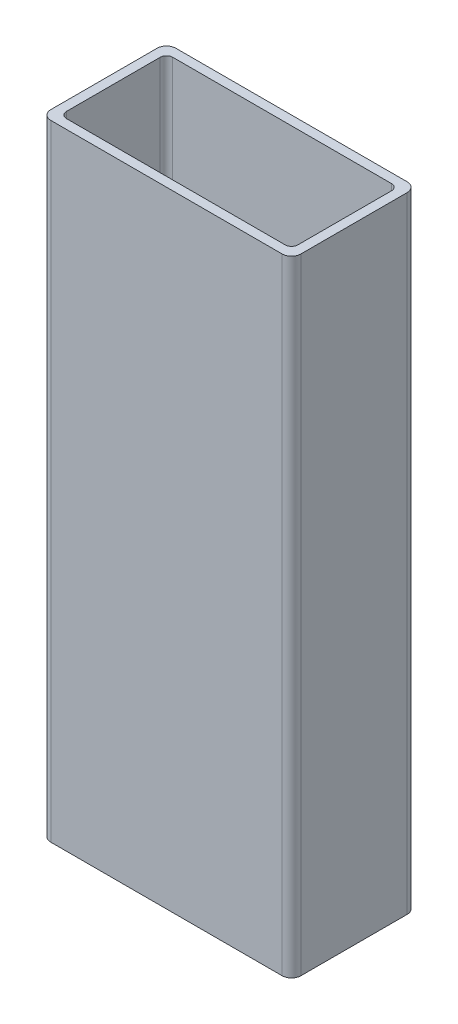
ISO-10303-21;
HEADER;
FILE_DESCRIPTION(('STEP AP214'),'2;1');
FILE_NAME('part.step','',(''),(''),'','','');
FILE_SCHEMA(('AUTOMOTIVE_DESIGN { 1 0 10303 214 1 1 1 1 }'));
ENDSEC;
DATA;
#1=APPLICATION_CONTEXT('core data for automotive mechanical design processes');
#2=APPLICATION_PROTOCOL_DEFINITION('international standard','automotive_design',2000,#1);
#3=PRODUCT_CONTEXT('',#1,'mechanical');
#4=PRODUCT('Part','Part','',(#3));
#5=PRODUCT_RELATED_PRODUCT_CATEGORY('part','',(#4));
#6=PRODUCT_DEFINITION_FORMATION('','',#4);
#7=PRODUCT_DEFINITION_CONTEXT('part definition',#1,'design');
#8=PRODUCT_DEFINITION('design','',#6,#7);
#9=PRODUCT_DEFINITION_SHAPE('','',#8);
#10=(LENGTH_UNIT() NAMED_UNIT(*) SI_UNIT(.MILLI.,.METRE.));
#11=(NAMED_UNIT(*) PLANE_ANGLE_UNIT() SI_UNIT($,.RADIAN.));
#12=(NAMED_UNIT(*) SI_UNIT($,.STERADIAN.) SOLID_ANGLE_UNIT());
#13=UNCERTAINTY_MEASURE_WITH_UNIT(LENGTH_MEASURE(1.E-05),#10,'distance_accuracy_value','');
#14=(GEOMETRIC_REPRESENTATION_CONTEXT(3) GLOBAL_UNCERTAINTY_ASSIGNED_CONTEXT((#13)) GLOBAL_UNIT_ASSIGNED_CONTEXT((#10,
#11,#12)) REPRESENTATION_CONTEXT('',''));
#15=CARTESIAN_POINT('',(0.,0.,0.));
#16=DIRECTION('',(0.,0.,1.));
#17=DIRECTION('',(1.,0.,0.));
#18=AXIS2_PLACEMENT_3D('',#15,#16,#17);
#19=CARTESIAN_POINT('',(18.5,100.,8.50000000000001));
#20=DIRECTION('',(0.,-1.,0.));
#21=DIRECTION('',(0.,0.,-1.));
#22=AXIS2_PLACEMENT_3D('',#19,#20,#21);
#23=PLANE('',#22);
#24=CARTESIAN_POINT('',(18.5,100.,8.50000000000001));
#25=DIRECTION('',(0.,1.,0.));
#26=DIRECTION('',(0.,0.,-1.));
#27=AXIS2_PLACEMENT_3D('',#24,#25,#26);
#28=CIRCLE('',#27,1.5);
#29=CARTESIAN_POINT('',(18.5,100.,10.));
#30=VERTEX_POINT('',#29);
#31=CARTESIAN_POINT('',(20.,100.,8.49999999999999));
#32=VERTEX_POINT('',#31);
#33=EDGE_CURVE('E214',#30,#32,#28,.T.);
#34=ORIENTED_EDGE('',*,*,#33,.T.);
#35=DIRECTION('',(0.,0.,-1.));
#36=VECTOR('',#35,1.);
#37=CARTESIAN_POINT('',(20.,100.,-8.49999999999999));
#38=LINE('',#37,#36);
#39=CARTESIAN_POINT('',(20.,100.,-8.49999999999999));
#40=VERTEX_POINT('',#39);
#41=EDGE_CURVE('E217',#32,#40,#38,.T.);
#42=ORIENTED_EDGE('',*,*,#41,.T.);
#43=CARTESIAN_POINT('',(18.5,100.,-8.49999999999999));
#44=DIRECTION('',(0.,1.,0.));
#45=DIRECTION('',(0.,0.,-1.));
#46=AXIS2_PLACEMENT_3D('',#43,#44,#45);
#47=CIRCLE('',#46,1.50000000000001);
#48=CARTESIAN_POINT('',(18.5,100.,-10.));
#49=VERTEX_POINT('',#48);
#50=EDGE_CURVE('E220',#40,#49,#47,.T.);
#51=ORIENTED_EDGE('',*,*,#50,.T.);
#52=DIRECTION('',(-1.,0.,0.));
#53=VECTOR('',#52,1.);
#54=CARTESIAN_POINT('',(18.5,100.,-10.));
#55=LINE('',#54,#53);
#56=CARTESIAN_POINT('',(-18.5,100.,-9.99999999999999));
#57=VERTEX_POINT('',#56);
#58=EDGE_CURVE('E222',#49,#57,#55,.T.);
#59=ORIENTED_EDGE('',*,*,#58,.T.);
#60=CARTESIAN_POINT('',(-18.5,100.,-8.49999999999999));
#61=DIRECTION('',(0.,1.,0.));
#62=DIRECTION('',(0.,0.,1.));
#63=AXIS2_PLACEMENT_3D('',#60,#61,#62);
#64=CIRCLE('',#63,1.5);
#65=CARTESIAN_POINT('',(-20.,100.,-8.49999999999999));
#66=VERTEX_POINT('',#65);
#67=EDGE_CURVE('E224',#57,#66,#64,.T.);
#68=ORIENTED_EDGE('',*,*,#67,.T.);
#69=DIRECTION('',(0.,0.,1.));
#70=VECTOR('',#69,1.);
#71=CARTESIAN_POINT('',(-20.,100.,-8.49999999999999));
#72=LINE('',#71,#70);
#73=CARTESIAN_POINT('',(-20.,100.,8.49999999999999));
#74=VERTEX_POINT('',#73);
#75=EDGE_CURVE('E226',#66,#74,#72,.T.);
#76=ORIENTED_EDGE('',*,*,#75,.T.);
#77=CARTESIAN_POINT('',(-18.5,100.,8.50000000000001));
#78=DIRECTION('',(0.,1.,0.));
#79=DIRECTION('',(0.,0.,-1.));
#80=AXIS2_PLACEMENT_3D('',#77,#78,#79);
#81=CIRCLE('',#80,1.5);
#82=CARTESIAN_POINT('',(-18.5,100.,10.));
#83=VERTEX_POINT('',#82);
#84=EDGE_CURVE('E228',#74,#83,#81,.T.);
#85=ORIENTED_EDGE('',*,*,#84,.T.);
#86=DIRECTION('',(1.,0.,0.));
#87=VECTOR('',#86,1.);
#88=CARTESIAN_POINT('',(18.5,100.,10.));
#89=LINE('',#88,#87);
#90=EDGE_CURVE('E230',#83,#30,#89,.T.);
#91=ORIENTED_EDGE('',*,*,#90,.T.);
#92=EDGE_LOOP('',(#34,#42,#51,#59,#68,#76,#85,#91));
#93=FACE_BOUND('',#92,.T.);
#94=CARTESIAN_POINT('',(-17.5,100.,7.50000000000001));
#95=DIRECTION('',(0.,1.,0.));
#96=DIRECTION('',(0.,0.,-1.));
#97=AXIS2_PLACEMENT_3D('',#94,#95,#96);
#98=CIRCLE('',#97,0.999999999999994);
#99=CARTESIAN_POINT('',(-18.5,100.,7.50000000000001));
#100=VERTEX_POINT('',#99);
#101=CARTESIAN_POINT('',(-17.5,100.,8.50000000000001));
#102=VERTEX_POINT('',#101);
#103=EDGE_CURVE('E149',#100,#102,#98,.T.);
#104=ORIENTED_EDGE('',*,*,#103,.F.);
#105=DIRECTION('',(0.,0.,1.));
#106=VECTOR('',#105,1.);
#107=CARTESIAN_POINT('',(-18.5,100.,-7.49999999999999));
#108=LINE('',#107,#106);
#109=CARTESIAN_POINT('',(-18.5,100.,-7.49999999999999));
#110=VERTEX_POINT('',#109);
#111=EDGE_CURVE('E182',#110,#100,#108,.T.);
#112=ORIENTED_EDGE('',*,*,#111,.F.);
#113=CARTESIAN_POINT('',(-17.5,100.,-7.49999999999999));
#114=DIRECTION('',(0.,1.,0.));
#115=DIRECTION('',(0.,0.,1.));
#116=AXIS2_PLACEMENT_3D('',#113,#114,#115);
#117=CIRCLE('',#116,0.999999999999997);
#118=CARTESIAN_POINT('',(-17.5,100.,-8.49999999999998));
#119=VERTEX_POINT('',#118);
#120=EDGE_CURVE('E180',#119,#110,#117,.T.);
#121=ORIENTED_EDGE('',*,*,#120,.F.);
#122=DIRECTION('',(-1.,0.,0.));
#123=VECTOR('',#122,1.);
#124=CARTESIAN_POINT('',(17.5,100.,-8.49999999999999));
#125=LINE('',#124,#123);
#126=CARTESIAN_POINT('',(17.5,100.,-8.49999999999999));
#127=VERTEX_POINT('',#126);
#128=EDGE_CURVE('E178',#127,#119,#125,.T.);
#129=ORIENTED_EDGE('',*,*,#128,.F.);
#130=CARTESIAN_POINT('',(17.5,100.,-7.49999999999999));
#131=DIRECTION('',(0.,1.,0.));
#132=DIRECTION('',(0.,0.,-1.));
#133=AXIS2_PLACEMENT_3D('',#130,#131,#132);
#134=CIRCLE('',#133,1.);
#135=CARTESIAN_POINT('',(18.5,100.,-7.49999999999999));
#136=VERTEX_POINT('',#135);
#137=EDGE_CURVE('E176',#136,#127,#134,.T.);
#138=ORIENTED_EDGE('',*,*,#137,.F.);
#139=DIRECTION('',(0.,0.,-1.));
#140=VECTOR('',#139,1.);
#141=CARTESIAN_POINT('',(18.5,100.,-7.49999999999999));
#142=LINE('',#141,#140);
#143=CARTESIAN_POINT('',(18.5,100.,7.50000000000001));
#144=VERTEX_POINT('',#143);
#145=EDGE_CURVE('E172',#144,#136,#142,.T.);
#146=ORIENTED_EDGE('',*,*,#145,.F.);
#147=CARTESIAN_POINT('',(17.5,100.,7.50000000000001));
#148=DIRECTION('',(0.,1.,0.));
#149=DIRECTION('',(0.,0.,-1.));
#150=AXIS2_PLACEMENT_3D('',#147,#148,#149);
#151=CIRCLE('',#150,1.);
#152=CARTESIAN_POINT('',(17.5,100.,8.50000000000001));
#153=VERTEX_POINT('',#152);
#154=EDGE_CURVE('E170',#153,#144,#151,.T.);
#155=ORIENTED_EDGE('',*,*,#154,.F.);
#156=DIRECTION('',(1.,0.,0.));
#157=VECTOR('',#156,1.);
#158=CARTESIAN_POINT('',(17.5,100.,8.50000000000001));
#159=LINE('',#158,#157);
#160=EDGE_CURVE('E157',#102,#153,#159,.T.);
#161=ORIENTED_EDGE('',*,*,#160,.F.);
#162=EDGE_LOOP('',(#104,#112,#121,#129,#138,#146,#155,#161));
#163=FACE_BOUND('',#162,.T.);
#164=ADVANCED_FACE('F36',(#93,#163),#23,.F.);
#165=CARTESIAN_POINT('',(18.5,0.,8.50000000000001));
#166=DIRECTION('',(0.,-1.,0.));
#167=DIRECTION('',(0.,0.,-1.));
#168=AXIS2_PLACEMENT_3D('',#165,#166,#167);
#169=PLANE('',#168);
#170=CARTESIAN_POINT('',(18.5,0.,8.50000000000001));
#171=DIRECTION('',(0.,1.,0.));
#172=DIRECTION('',(0.,0.,-1.));
#173=AXIS2_PLACEMENT_3D('',#170,#171,#172);
#174=CIRCLE('',#173,1.5);
#175=CARTESIAN_POINT('',(18.5,0.,10.));
#176=VERTEX_POINT('',#175);
#177=CARTESIAN_POINT('',(20.,0.,8.49999999999999));
#178=VERTEX_POINT('',#177);
#179=EDGE_CURVE('E165',#176,#178,#174,.T.);
#180=ORIENTED_EDGE('',*,*,#179,.F.);
#181=DIRECTION('',(1.,0.,0.));
#182=VECTOR('',#181,1.);
#183=CARTESIAN_POINT('',(18.5,0.,10.));
#184=LINE('',#183,#182);
#185=CARTESIAN_POINT('',(-18.5,0.,10.));
#186=VERTEX_POINT('',#185);
#187=EDGE_CURVE('E218',#186,#176,#184,.T.);
#188=ORIENTED_EDGE('',*,*,#187,.F.);
#189=CARTESIAN_POINT('',(-18.5,0.,8.50000000000001));
#190=DIRECTION('',(0.,1.,0.));
#191=DIRECTION('',(0.,0.,-1.));
#192=AXIS2_PLACEMENT_3D('',#189,#190,#191);
#193=CIRCLE('',#192,1.5);
#194=CARTESIAN_POINT('',(-20.,0.,8.49999999999999));
#195=VERTEX_POINT('',#194);
#196=EDGE_CURVE('E245',#195,#186,#193,.T.);
#197=ORIENTED_EDGE('',*,*,#196,.F.);
#198=DIRECTION('',(0.,0.,1.));
#199=VECTOR('',#198,1.);
#200=CARTESIAN_POINT('',(-20.,0.,-8.49999999999999));
#201=LINE('',#200,#199);
#202=CARTESIAN_POINT('',(-20.,0.,-8.49999999999999));
#203=VERTEX_POINT('',#202);
#204=EDGE_CURVE('E243',#203,#195,#201,.T.);
#205=ORIENTED_EDGE('',*,*,#204,.F.);
#206=CARTESIAN_POINT('',(-18.5,0.,-8.49999999999999));
#207=DIRECTION('',(0.,1.,0.));
#208=DIRECTION('',(0.,0.,1.));
#209=AXIS2_PLACEMENT_3D('',#206,#207,#208);
#210=CIRCLE('',#209,1.5);
#211=CARTESIAN_POINT('',(-18.5,0.,-9.99999999999999));
#212=VERTEX_POINT('',#211);
#213=EDGE_CURVE('E241',#212,#203,#210,.T.);
#214=ORIENTED_EDGE('',*,*,#213,.F.);
#215=DIRECTION('',(-1.,0.,0.));
#216=VECTOR('',#215,1.);
#217=CARTESIAN_POINT('',(18.5,0.,-10.));
#218=LINE('',#217,#216);
#219=CARTESIAN_POINT('',(18.5,0.,-10.));
#220=VERTEX_POINT('',#219);
#221=EDGE_CURVE('E239',#220,#212,#218,.T.);
#222=ORIENTED_EDGE('',*,*,#221,.F.);
#223=CARTESIAN_POINT('',(18.5,0.,-8.49999999999999));
#224=DIRECTION('',(0.,1.,0.));
#225=DIRECTION('',(0.,0.,-1.));
#226=AXIS2_PLACEMENT_3D('',#223,#224,#225);
#227=CIRCLE('',#226,1.50000000000001);
#228=CARTESIAN_POINT('',(20.,0.,-8.49999999999999));
#229=VERTEX_POINT('',#228);
#230=EDGE_CURVE('E237',#229,#220,#227,.T.);
#231=ORIENTED_EDGE('',*,*,#230,.F.);
#232=DIRECTION('',(0.,0.,-1.));
#233=VECTOR('',#232,1.);
#234=CARTESIAN_POINT('',(20.,0.,-8.49999999999999));
#235=LINE('',#234,#233);
#236=EDGE_CURVE('E235',#178,#229,#235,.T.);
#237=ORIENTED_EDGE('',*,*,#236,.F.);
#238=EDGE_LOOP('',(#180,#188,#197,#205,#214,#222,#231,#237));
#239=FACE_BOUND('',#238,.T.);
#240=DIRECTION('',(0.,0.,1.));
#241=VECTOR('',#240,1.);
#242=CARTESIAN_POINT('',(-18.5,0.,-7.49999999999999));
#243=LINE('',#242,#241);
#244=CARTESIAN_POINT('',(-18.5,0.,-7.49999999999999));
#245=VERTEX_POINT('',#244);
#246=CARTESIAN_POINT('',(-18.5,0.,7.50000000000001));
#247=VERTEX_POINT('',#246);
#248=EDGE_CURVE('E158',#245,#247,#243,.T.);
#249=ORIENTED_EDGE('',*,*,#248,.T.);
#250=CARTESIAN_POINT('',(-17.5,0.,7.50000000000001));
#251=DIRECTION('',(0.,1.,0.));
#252=DIRECTION('',(0.,0.,-1.));
#253=AXIS2_PLACEMENT_3D('',#250,#251,#252);
#254=CIRCLE('',#253,0.999999999999994);
#255=CARTESIAN_POINT('',(-17.5,0.,8.50000000000001));
#256=VERTEX_POINT('',#255);
#257=EDGE_CURVE('E59',#247,#256,#254,.T.);
#258=ORIENTED_EDGE('',*,*,#257,.T.);
#259=DIRECTION('',(1.,0.,0.));
#260=VECTOR('',#259,1.);
#261=CARTESIAN_POINT('',(17.5,0.,8.50000000000001));
#262=LINE('',#261,#260);
#263=CARTESIAN_POINT('',(17.5,0.,8.50000000000001));
#264=VERTEX_POINT('',#263);
#265=EDGE_CURVE('E164',#256,#264,#262,.T.);
#266=ORIENTED_EDGE('',*,*,#265,.T.);
#267=CARTESIAN_POINT('',(17.5,0.,7.50000000000001));
#268=DIRECTION('',(0.,1.,0.));
#269=DIRECTION('',(0.,0.,-1.));
#270=AXIS2_PLACEMENT_3D('',#267,#268,#269);
#271=CIRCLE('',#270,1.);
#272=CARTESIAN_POINT('',(18.5,0.,7.50000000000001));
#273=VERTEX_POINT('',#272);
#274=EDGE_CURVE('E186',#264,#273,#271,.T.);
#275=ORIENTED_EDGE('',*,*,#274,.T.);
#276=DIRECTION('',(0.,0.,-1.));
#277=VECTOR('',#276,1.);
#278=CARTESIAN_POINT('',(18.5,0.,-7.49999999999999));
#279=LINE('',#278,#277);
#280=CARTESIAN_POINT('',(18.5,0.,-7.49999999999999));
#281=VERTEX_POINT('',#280);
#282=EDGE_CURVE('E189',#273,#281,#279,.T.);
#283=ORIENTED_EDGE('',*,*,#282,.T.);
#284=CARTESIAN_POINT('',(17.5,0.,-7.49999999999999));
#285=DIRECTION('',(0.,1.,0.));
#286=DIRECTION('',(0.,0.,-1.));
#287=AXIS2_PLACEMENT_3D('',#284,#285,#286);
#288=CIRCLE('',#287,1.);
#289=CARTESIAN_POINT('',(17.5,0.,-8.49999999999999));
#290=VERTEX_POINT('',#289);
#291=EDGE_CURVE('E192',#281,#290,#288,.T.);
#292=ORIENTED_EDGE('',*,*,#291,.T.);
#293=DIRECTION('',(-1.,0.,0.));
#294=VECTOR('',#293,1.);
#295=CARTESIAN_POINT('',(17.5,0.,-8.49999999999999));
#296=LINE('',#295,#294);
#297=CARTESIAN_POINT('',(-17.5,0.,-8.49999999999998));
#298=VERTEX_POINT('',#297);
#299=EDGE_CURVE('E195',#290,#298,#296,.T.);
#300=ORIENTED_EDGE('',*,*,#299,.T.);
#301=CARTESIAN_POINT('',(-17.5,0.,-7.49999999999999));
#302=DIRECTION('',(0.,1.,0.));
#303=DIRECTION('',(0.,0.,1.));
#304=AXIS2_PLACEMENT_3D('',#301,#302,#303);
#305=CIRCLE('',#304,0.999999999999997);
#306=EDGE_CURVE('E198',#298,#245,#305,.T.);
#307=ORIENTED_EDGE('',*,*,#306,.T.);
#308=EDGE_LOOP('',(#249,#258,#266,#275,#283,#292,#300,#307));
#309=FACE_BOUND('',#308,.T.);
#310=ADVANCED_FACE('F275',(#239,#309),#169,.T.);
#311=CARTESIAN_POINT('',(18.5,100.,8.50000000000001));
#312=DIRECTION('',(0.,-1.,0.));
#313=DIRECTION('',(0.,0.,-1.));
#314=AXIS2_PLACEMENT_3D('',#311,#312,#313);
#315=CYLINDRICAL_SURFACE('',#314,1.5);
#316=ORIENTED_EDGE('',*,*,#179,.T.);
#317=DIRECTION('',(0.,-1.,0.));
#318=VECTOR('',#317,1.);
#319=CARTESIAN_POINT('',(20.,100.,8.49999999999999));
#320=LINE('',#319,#318);
#321=EDGE_CURVE('E11',#32,#178,#320,.T.);
#322=ORIENTED_EDGE('',*,*,#321,.F.);
#323=ORIENTED_EDGE('',*,*,#33,.F.);
#324=DIRECTION('',(0.,-1.,0.));
#325=VECTOR('',#324,1.);
#326=CARTESIAN_POINT('',(18.5,100.,10.));
#327=LINE('',#326,#325);
#328=EDGE_CURVE('E232',#30,#176,#327,.T.);
#329=ORIENTED_EDGE('',*,*,#328,.T.);
#330=EDGE_LOOP('',(#316,#322,#323,#329));
#331=FACE_BOUND('',#330,.T.);
#332=ADVANCED_FACE('F38',(#331),#315,.T.);
#333=CARTESIAN_POINT('',(20.,100.,-8.49999999999999));
#334=DIRECTION('',(-1.,0.,0.));
#335=DIRECTION('',(0.,0.,1.));
#336=AXIS2_PLACEMENT_3D('',#333,#334,#335);
#337=PLANE('',#336);
#338=ORIENTED_EDGE('',*,*,#236,.T.);
#339=DIRECTION('',(0.,-1.,0.));
#340=VECTOR('',#339,1.);
#341=CARTESIAN_POINT('',(20.,100.,-8.49999999999999));
#342=LINE('',#341,#340);
#343=EDGE_CURVE('E44',#40,#229,#342,.T.);
#344=ORIENTED_EDGE('',*,*,#343,.F.);
#345=ORIENTED_EDGE('',*,*,#41,.F.);
#346=ORIENTED_EDGE('',*,*,#321,.T.);
#347=EDGE_LOOP('',(#338,#344,#345,#346));
#348=FACE_BOUND('',#347,.T.);
#349=ADVANCED_FACE('F292',(#348),#337,.F.);
#350=CARTESIAN_POINT('',(18.5,100.,-8.49999999999999));
#351=DIRECTION('',(0.,-1.,0.));
#352=DIRECTION('',(0.,0.,-1.));
#353=AXIS2_PLACEMENT_3D('',#350,#351,#352);
#354=CYLINDRICAL_SURFACE('',#353,1.50000000000001);
#355=ORIENTED_EDGE('',*,*,#230,.T.);
#356=DIRECTION('',(0.,-1.,0.));
#357=VECTOR('',#356,1.);
#358=CARTESIAN_POINT('',(18.5,100.,-10.));
#359=LINE('',#358,#357);
#360=EDGE_CURVE('E262',#49,#220,#359,.T.);
#361=ORIENTED_EDGE('',*,*,#360,.F.);
#362=ORIENTED_EDGE('',*,*,#50,.F.);
#363=ORIENTED_EDGE('',*,*,#343,.T.);
#364=EDGE_LOOP('',(#355,#361,#362,#363));
#365=FACE_BOUND('',#364,.T.);
#366=ADVANCED_FACE('F269',(#365),#354,.T.);
#367=CARTESIAN_POINT('',(18.5,100.,-10.));
#368=DIRECTION('',(0.,0.,1.));
#369=DIRECTION('',(1.,0.,0.));
#370=AXIS2_PLACEMENT_3D('',#367,#368,#369);
#371=PLANE('',#370);
#372=ORIENTED_EDGE('',*,*,#221,.T.);
#373=DIRECTION('',(0.,-1.,0.));
#374=VECTOR('',#373,1.);
#375=CARTESIAN_POINT('',(-18.5,100.,-9.99999999999999));
#376=LINE('',#375,#374);
#377=EDGE_CURVE('E259',#57,#212,#376,.T.);
#378=ORIENTED_EDGE('',*,*,#377,.F.);
#379=ORIENTED_EDGE('',*,*,#58,.F.);
#380=ORIENTED_EDGE('',*,*,#360,.T.);
#381=EDGE_LOOP('',(#372,#378,#379,#380));
#382=FACE_BOUND('',#381,.T.);
#383=ADVANCED_FACE('F281',(#382),#371,.F.);
#384=CARTESIAN_POINT('',(-18.5,100.,-8.49999999999999));
#385=DIRECTION('',(0.,-1.,0.));
#386=DIRECTION('',(0.,0.,-1.));
#387=AXIS2_PLACEMENT_3D('',#384,#385,#386);
#388=CYLINDRICAL_SURFACE('',#387,1.5);
#389=ORIENTED_EDGE('',*,*,#213,.T.);
#390=DIRECTION('',(0.,-1.,0.));
#391=VECTOR('',#390,1.);
#392=CARTESIAN_POINT('',(-20.,100.,-8.49999999999999));
#393=LINE('',#392,#391);
#394=EDGE_CURVE('E256',#66,#203,#393,.T.);
#395=ORIENTED_EDGE('',*,*,#394,.F.);
#396=ORIENTED_EDGE('',*,*,#67,.F.);
#397=ORIENTED_EDGE('',*,*,#377,.T.);
#398=EDGE_LOOP('',(#389,#395,#396,#397));
#399=FACE_BOUND('',#398,.T.);
#400=ADVANCED_FACE('F285',(#399),#388,.T.);
#401=CARTESIAN_POINT('',(-20.,100.,-8.49999999999999));
#402=DIRECTION('',(1.,0.,0.));
#403=DIRECTION('',(0.,0.,-1.));
#404=AXIS2_PLACEMENT_3D('',#401,#402,#403);
#405=PLANE('',#404);
#406=ORIENTED_EDGE('',*,*,#204,.T.);
#407=DIRECTION('',(0.,-1.,0.));
#408=VECTOR('',#407,1.);
#409=CARTESIAN_POINT('',(-20.,100.,8.49999999999999));
#410=LINE('',#409,#408);
#411=EDGE_CURVE('E253',#74,#195,#410,.T.);
#412=ORIENTED_EDGE('',*,*,#411,.F.);
#413=ORIENTED_EDGE('',*,*,#75,.F.);
#414=ORIENTED_EDGE('',*,*,#394,.T.);
#415=EDGE_LOOP('',(#406,#412,#413,#414));
#416=FACE_BOUND('',#415,.T.);
#417=ADVANCED_FACE('F305',(#416),#405,.F.);
#418=CARTESIAN_POINT('',(-18.5,100.,8.50000000000001));
#419=DIRECTION('',(0.,-1.,0.));
#420=DIRECTION('',(0.,0.,-1.));
#421=AXIS2_PLACEMENT_3D('',#418,#419,#420);
#422=CYLINDRICAL_SURFACE('',#421,1.5);
#423=ORIENTED_EDGE('',*,*,#196,.T.);
#424=DIRECTION('',(0.,-1.,0.));
#425=VECTOR('',#424,1.);
#426=CARTESIAN_POINT('',(-18.5,100.,10.));
#427=LINE('',#426,#425);
#428=EDGE_CURVE('E250',#83,#186,#427,.T.);
#429=ORIENTED_EDGE('',*,*,#428,.F.);
#430=ORIENTED_EDGE('',*,*,#84,.F.);
#431=ORIENTED_EDGE('',*,*,#411,.T.);
#432=EDGE_LOOP('',(#423,#429,#430,#431));
#433=FACE_BOUND('',#432,.T.);
#434=ADVANCED_FACE('F303',(#433),#422,.T.);
#435=CARTESIAN_POINT('',(18.5,100.,10.));
#436=DIRECTION('',(0.,0.,-1.));
#437=DIRECTION('',(-1.,0.,0.));
#438=AXIS2_PLACEMENT_3D('',#435,#436,#437);
#439=PLANE('',#438);
#440=ORIENTED_EDGE('',*,*,#187,.T.);
#441=ORIENTED_EDGE('',*,*,#328,.F.);
#442=ORIENTED_EDGE('',*,*,#90,.F.);
#443=ORIENTED_EDGE('',*,*,#428,.T.);
#444=EDGE_LOOP('',(#440,#441,#442,#443));
#445=FACE_BOUND('',#444,.T.);
#446=ADVANCED_FACE('F298',(#445),#439,.F.);
#447=CARTESIAN_POINT('',(-17.5,100.,7.50000000000001));
#448=DIRECTION('',(0.,-1.,0.));
#449=DIRECTION('',(0.,0.,-1.));
#450=AXIS2_PLACEMENT_3D('',#447,#448,#449);
#451=CYLINDRICAL_SURFACE('',#450,0.999999999999994);
#452=ORIENTED_EDGE('',*,*,#257,.F.);
#453=DIRECTION('',(0.,-1.,0.));
#454=VECTOR('',#453,1.);
#455=CARTESIAN_POINT('',(-18.5,100.,7.50000000000001));
#456=LINE('',#455,#454);
#457=EDGE_CURVE('E153',#100,#247,#456,.T.);
#458=ORIENTED_EDGE('',*,*,#457,.F.);
#459=ORIENTED_EDGE('',*,*,#103,.T.);
#460=DIRECTION('',(0.,-1.,0.));
#461=VECTOR('',#460,1.);
#462=CARTESIAN_POINT('',(-17.5,100.,8.50000000000001));
#463=LINE('',#462,#461);
#464=EDGE_CURVE('E152',#102,#256,#463,.T.);
#465=ORIENTED_EDGE('',*,*,#464,.T.);
#466=EDGE_LOOP('',(#452,#458,#459,#465));
#467=FACE_BOUND('',#466,.T.);
#468=ADVANCED_FACE('F151',(#467),#451,.F.);
#469=CARTESIAN_POINT('',(17.5,100.,8.50000000000001));
#470=DIRECTION('',(0.,0.,-1.));
#471=DIRECTION('',(-1.,0.,0.));
#472=AXIS2_PLACEMENT_3D('',#469,#470,#471);
#473=PLANE('',#472);
#474=ORIENTED_EDGE('',*,*,#265,.F.);
#475=ORIENTED_EDGE('',*,*,#464,.F.);
#476=ORIENTED_EDGE('',*,*,#160,.T.);
#477=DIRECTION('',(0.,-1.,0.));
#478=VECTOR('',#477,1.);
#479=CARTESIAN_POINT('',(17.5,100.,8.50000000000001));
#480=LINE('',#479,#478);
#481=EDGE_CURVE('E166',#153,#264,#480,.T.);
#482=ORIENTED_EDGE('',*,*,#481,.T.);
#483=EDGE_LOOP('',(#474,#475,#476,#482));
#484=FACE_BOUND('',#483,.T.);
#485=ADVANCED_FACE('F161',(#484),#473,.T.);
#486=CARTESIAN_POINT('',(17.5,100.,7.50000000000001));
#487=DIRECTION('',(0.,-1.,0.));
#488=DIRECTION('',(0.,0.,-1.));
#489=AXIS2_PLACEMENT_3D('',#486,#487,#488);
#490=CYLINDRICAL_SURFACE('',#489,1.);
#491=ORIENTED_EDGE('',*,*,#274,.F.);
#492=ORIENTED_EDGE('',*,*,#481,.F.);
#493=ORIENTED_EDGE('',*,*,#154,.T.);
#494=DIRECTION('',(0.,-1.,0.));
#495=VECTOR('',#494,1.);
#496=CARTESIAN_POINT('',(18.5,100.,7.50000000000001));
#497=LINE('',#496,#495);
#498=EDGE_CURVE('E211',#144,#273,#497,.T.);
#499=ORIENTED_EDGE('',*,*,#498,.T.);
#500=EDGE_LOOP('',(#491,#492,#493,#499));
#501=FACE_BOUND('',#500,.T.);
#502=ADVANCED_FACE('F330',(#501),#490,.F.);
#503=CARTESIAN_POINT('',(18.5,100.,-7.49999999999999));
#504=DIRECTION('',(-1.,0.,0.));
#505=DIRECTION('',(0.,0.,1.));
#506=AXIS2_PLACEMENT_3D('',#503,#504,#505);
#507=PLANE('',#506);
#508=ORIENTED_EDGE('',*,*,#282,.F.);
#509=ORIENTED_EDGE('',*,*,#498,.F.);
#510=ORIENTED_EDGE('',*,*,#145,.T.);
#511=DIRECTION('',(0.,-1.,0.));
#512=VECTOR('',#511,1.);
#513=CARTESIAN_POINT('',(18.5,100.,-7.49999999999999));
#514=LINE('',#513,#512);
#515=EDGE_CURVE('E209',#136,#281,#514,.T.);
#516=ORIENTED_EDGE('',*,*,#515,.T.);
#517=EDGE_LOOP('',(#508,#509,#510,#516));
#518=FACE_BOUND('',#517,.T.);
#519=ADVANCED_FACE('F334',(#518),#507,.T.);
#520=CARTESIAN_POINT('',(17.5,100.,-7.49999999999999));
#521=DIRECTION('',(0.,-1.,0.));
#522=DIRECTION('',(0.,0.,-1.));
#523=AXIS2_PLACEMENT_3D('',#520,#521,#522);
#524=CYLINDRICAL_SURFACE('',#523,1.);
#525=ORIENTED_EDGE('',*,*,#291,.F.);
#526=ORIENTED_EDGE('',*,*,#515,.F.);
#527=ORIENTED_EDGE('',*,*,#137,.T.);
#528=DIRECTION('',(0.,-1.,0.));
#529=VECTOR('',#528,1.);
#530=CARTESIAN_POINT('',(17.5,100.,-8.49999999999999));
#531=LINE('',#530,#529);
#532=EDGE_CURVE('E207',#127,#290,#531,.T.);
#533=ORIENTED_EDGE('',*,*,#532,.T.);
#534=EDGE_LOOP('',(#525,#526,#527,#533));
#535=FACE_BOUND('',#534,.T.);
#536=ADVANCED_FACE('F340',(#535),#524,.F.);
#537=CARTESIAN_POINT('',(17.5,100.,-8.49999999999999));
#538=DIRECTION('',(0.,0.,1.));
#539=DIRECTION('',(1.,0.,0.));
#540=AXIS2_PLACEMENT_3D('',#537,#538,#539);
#541=PLANE('',#540);
#542=ORIENTED_EDGE('',*,*,#299,.F.);
#543=ORIENTED_EDGE('',*,*,#532,.F.);
#544=ORIENTED_EDGE('',*,*,#128,.T.);
#545=DIRECTION('',(0.,-1.,0.));
#546=VECTOR('',#545,1.);
#547=CARTESIAN_POINT('',(-17.5,100.,-8.49999999999998));
#548=LINE('',#547,#546);
#549=EDGE_CURVE('E205',#119,#298,#548,.T.);
#550=ORIENTED_EDGE('',*,*,#549,.T.);
#551=EDGE_LOOP('',(#542,#543,#544,#550));
#552=FACE_BOUND('',#551,.T.);
#553=ADVANCED_FACE('F344',(#552),#541,.T.);
#554=CARTESIAN_POINT('',(-17.5,100.,-7.49999999999999));
#555=DIRECTION('',(0.,-1.,0.));
#556=DIRECTION('',(0.,0.,-1.));
#557=AXIS2_PLACEMENT_3D('',#554,#555,#556);
#558=CYLINDRICAL_SURFACE('',#557,0.999999999999997);
#559=ORIENTED_EDGE('',*,*,#306,.F.);
#560=ORIENTED_EDGE('',*,*,#549,.F.);
#561=ORIENTED_EDGE('',*,*,#120,.T.);
#562=DIRECTION('',(0.,-1.,0.));
#563=VECTOR('',#562,1.);
#564=CARTESIAN_POINT('',(-18.5,100.,-7.49999999999999));
#565=LINE('',#564,#563);
#566=EDGE_CURVE('E51',#110,#245,#565,.T.);
#567=ORIENTED_EDGE('',*,*,#566,.T.);
#568=EDGE_LOOP('',(#559,#560,#561,#567));
#569=FACE_BOUND('',#568,.T.);
#570=ADVANCED_FACE('F348',(#569),#558,.F.);
#571=CARTESIAN_POINT('',(-18.5,100.,-7.49999999999999));
#572=DIRECTION('',(1.,0.,0.));
#573=DIRECTION('',(0.,0.,-1.));
#574=AXIS2_PLACEMENT_3D('',#571,#572,#573);
#575=PLANE('',#574);
#576=ORIENTED_EDGE('',*,*,#248,.F.);
#577=ORIENTED_EDGE('',*,*,#566,.F.);
#578=ORIENTED_EDGE('',*,*,#111,.T.);
#579=ORIENTED_EDGE('',*,*,#457,.T.);
#580=EDGE_LOOP('',(#576,#577,#578,#579));
#581=FACE_BOUND('',#580,.T.);
#582=ADVANCED_FACE('F352',(#581),#575,.T.);
#583=CLOSED_SHELL('',(#164,#310,#332,#349,#366,#383,#400,#417,#434,#446,#468,#485,#502,#519,
#536,#553,#570,#582));
#584=MANIFOLD_SOLID_BREP('B2',#583);
#585=ADVANCED_BREP_SHAPE_REPRESENTATION('',(#18,#584),#14);
#586=SHAPE_DEFINITION_REPRESENTATION(#9,#585);
ENDSEC;
END-ISO-10303-21;
